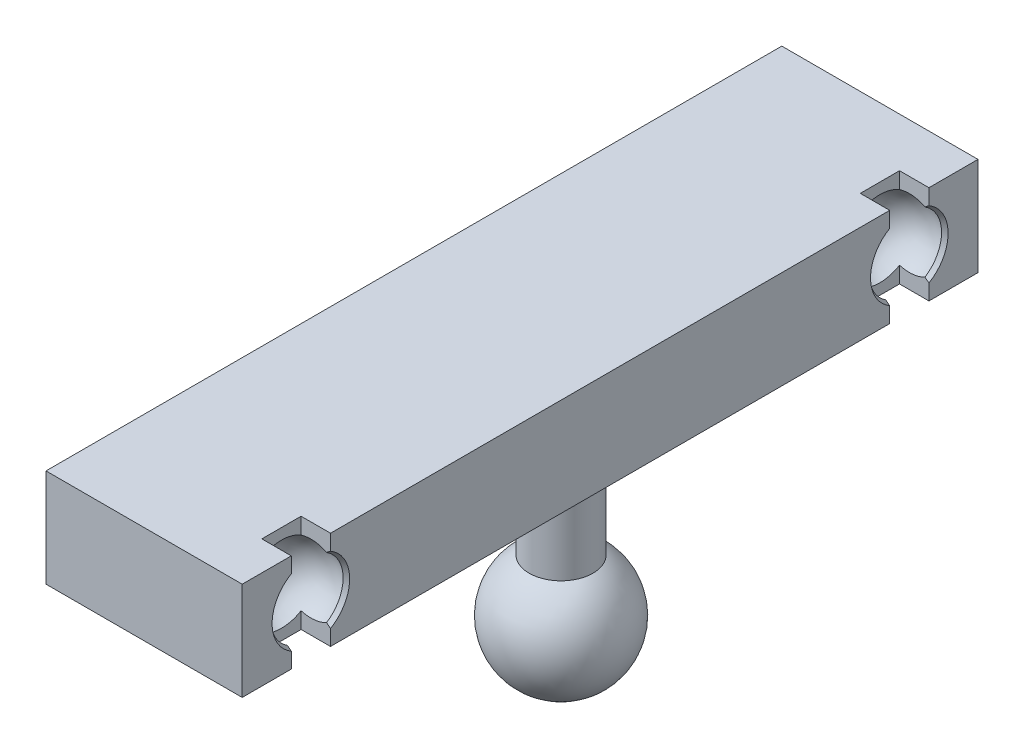
ISO-10303-21;
HEADER;
FILE_DESCRIPTION(('STEP AP214'),'2;1');
FILE_NAME('part.step','',(''),(''),'','','');
FILE_SCHEMA(('AUTOMOTIVE_DESIGN { 1 0 10303 214 1 1 1 1 }'));
ENDSEC;
DATA;
#1=APPLICATION_CONTEXT('core data for automotive mechanical design processes');
#2=APPLICATION_PROTOCOL_DEFINITION('international standard','automotive_design',2000,#1);
#3=PRODUCT_CONTEXT('',#1,'mechanical');
#4=PRODUCT('Part','Part','',(#3));
#5=PRODUCT_RELATED_PRODUCT_CATEGORY('part','',(#4));
#6=PRODUCT_DEFINITION_FORMATION('','',#4);
#7=PRODUCT_DEFINITION_CONTEXT('part definition',#1,'design');
#8=PRODUCT_DEFINITION('design','',#6,#7);
#9=PRODUCT_DEFINITION_SHAPE('','',#8);
#10=(LENGTH_UNIT() NAMED_UNIT(*) SI_UNIT(.MILLI.,.METRE.));
#11=(NAMED_UNIT(*) PLANE_ANGLE_UNIT() SI_UNIT($,.RADIAN.));
#12=(NAMED_UNIT(*) SI_UNIT($,.STERADIAN.) SOLID_ANGLE_UNIT());
#13=UNCERTAINTY_MEASURE_WITH_UNIT(LENGTH_MEASURE(1.E-05),#10,'distance_accuracy_value','');
#14=(GEOMETRIC_REPRESENTATION_CONTEXT(3) GLOBAL_UNCERTAINTY_ASSIGNED_CONTEXT((#13)) GLOBAL_UNIT_ASSIGNED_CONTEXT((#10,
#11,#12)) REPRESENTATION_CONTEXT('',''));
#15=CARTESIAN_POINT('',(0.,0.,0.));
#16=DIRECTION('',(0.,0.,1.));
#17=DIRECTION('',(1.,0.,0.));
#18=AXIS2_PLACEMENT_3D('',#15,#16,#17);
#19=CARTESIAN_POINT('',(5.,24.,37.5));
#20=DIRECTION('',(-1.,0.,0.));
#21=DIRECTION('',(0.,-1.,0.));
#22=AXIS2_PLACEMENT_3D('',#19,#20,#21);
#23=PLANE('',#22);
#24=DIRECTION('',(0.,-1.,0.));
#25=VECTOR('',#24,1.);
#26=CARTESIAN_POINT('',(5.,24.,-28.4999999996869));
#27=LINE('',#26,#25);
#28=CARTESIAN_POINT('',(5.,15.5872673892127,-28.4999999996869));
#29=VERTEX_POINT('',#28);
#30=CARTESIAN_POINT('',(5.,14.,-28.4999999996869));
#31=VERTEX_POINT('',#30);
#32=EDGE_CURVE('E530',#29,#31,#27,.T.);
#33=ORIENTED_EDGE('',*,*,#32,.F.);
#34=CARTESIAN_POINT('',(5.,19.,-30.5));
#35=DIRECTION('',(-1.,0.,0.));
#36=DIRECTION('',(0.,-1.,0.));
#37=AXIS2_PLACEMENT_3D('',#34,#35,#36);
#38=CIRCLE('',#37,3.9555965256815);
#39=CARTESIAN_POINT('',(5.,22.4127326107873,-28.4999999996869));
#40=VERTEX_POINT('',#39);
#41=EDGE_CURVE('E321',#29,#40,#38,.T.);
#42=ORIENTED_EDGE('',*,*,#41,.T.);
#43=CARTESIAN_POINT('',(5.,24.,-28.4999999996869));
#44=VERTEX_POINT('',#43);
#45=EDGE_CURVE('E513',#44,#40,#27,.T.);
#46=ORIENTED_EDGE('',*,*,#45,.F.);
#47=DIRECTION('',(0.,0.,-1.));
#48=VECTOR('',#47,1.);
#49=CARTESIAN_POINT('',(5.,24.,37.5));
#50=LINE('',#49,#48);
#51=CARTESIAN_POINT('',(5.,24.,28.4999999996869));
#52=VERTEX_POINT('',#51);
#53=EDGE_CURVE('E248',#52,#44,#50,.T.);
#54=ORIENTED_EDGE('',*,*,#53,.F.);
#55=DIRECTION('',(0.,-1.,0.));
#56=VECTOR('',#55,1.);
#57=CARTESIAN_POINT('',(5.,24.,28.4999999996869));
#58=LINE('',#57,#56);
#59=CARTESIAN_POINT('',(5.,22.4127326107873,28.4999999996869));
#60=VERTEX_POINT('',#59);
#61=EDGE_CURVE('E567',#52,#60,#58,.T.);
#62=ORIENTED_EDGE('',*,*,#61,.T.);
#63=CARTESIAN_POINT('',(5.,19.,30.5));
#64=DIRECTION('',(-1.,0.,0.));
#65=DIRECTION('',(0.,-1.,0.));
#66=AXIS2_PLACEMENT_3D('',#63,#64,#65);
#67=CIRCLE('',#66,3.95559652568149);
#68=CARTESIAN_POINT('',(5.,15.5872673892127,28.4999999996869));
#69=VERTEX_POINT('',#68);
#70=EDGE_CURVE('E317',#60,#69,#67,.T.);
#71=ORIENTED_EDGE('',*,*,#70,.T.);
#72=CARTESIAN_POINT('',(5.,14.,28.4999999996869));
#73=VERTEX_POINT('',#72);
#74=EDGE_CURVE('E574',#69,#73,#58,.T.);
#75=ORIENTED_EDGE('',*,*,#74,.T.);
#76=DIRECTION('',(0.,0.,-1.));
#77=VECTOR('',#76,1.);
#78=CARTESIAN_POINT('',(5.,14.,37.5));
#79=LINE('',#78,#77);
#80=EDGE_CURVE('E539',#73,#31,#79,.T.);
#81=ORIENTED_EDGE('',*,*,#80,.T.);
#82=EDGE_LOOP('',(#33,#42,#46,#54,#62,#71,#75,#81));
#83=FACE_BOUND('',#82,.T.);
#84=ADVANCED_FACE('F53',(#83),#23,.F.);
#85=DIRECTION('',(0.,-1.,0.));
#86=VECTOR('',#85,1.);
#87=CARTESIAN_POINT('',(5.,24.,32.4999999996869));
#88=LINE('',#87,#86);
#89=CARTESIAN_POINT('',(5.,15.5872673888457,32.4999999996869));
#90=VERTEX_POINT('',#89);
#91=CARTESIAN_POINT('',(5.,14.,32.4999999996869));
#92=VERTEX_POINT('',#91);
#93=EDGE_CURVE('E239',#90,#92,#88,.T.);
#94=ORIENTED_EDGE('',*,*,#93,.F.);
#95=CARTESIAN_POINT('',(5.,19.,30.5));
#96=DIRECTION('',(-1.,0.,0.));
#97=DIRECTION('',(0.,-1.,0.));
#98=AXIS2_PLACEMENT_3D('',#95,#96,#97);
#99=CIRCLE('',#98,3.95559652568149);
#100=CARTESIAN_POINT('',(5.,22.4127326111543,32.4999999996869));
#101=VERTEX_POINT('',#100);
#102=EDGE_CURVE('E236',#90,#101,#99,.T.);
#103=ORIENTED_EDGE('',*,*,#102,.T.);
#104=CARTESIAN_POINT('',(5.,24.,32.4999999996869));
#105=VERTEX_POINT('',#104);
#106=EDGE_CURVE('E222',#105,#101,#88,.T.);
#107=ORIENTED_EDGE('',*,*,#106,.F.);
#108=CARTESIAN_POINT('',(5.,24.,37.5));
#109=VERTEX_POINT('',#108);
#110=EDGE_CURVE('E235',#109,#105,#50,.T.);
#111=ORIENTED_EDGE('',*,*,#110,.F.);
#112=DIRECTION('',(0.,-1.,0.));
#113=VECTOR('',#112,1.);
#114=CARTESIAN_POINT('',(5.,24.,37.5));
#115=LINE('',#114,#113);
#116=CARTESIAN_POINT('',(5.,14.,37.5));
#117=VERTEX_POINT('',#116);
#118=EDGE_CURVE('E272',#109,#117,#115,.T.);
#119=ORIENTED_EDGE('',*,*,#118,.T.);
#120=EDGE_CURVE('E541',#117,#92,#79,.T.);
#121=ORIENTED_EDGE('',*,*,#120,.T.);
#122=EDGE_LOOP('',(#94,#103,#107,#111,#119,#121));
#123=FACE_BOUND('',#122,.T.);
#124=ADVANCED_FACE('F233',(#123),#23,.F.);
#125=CARTESIAN_POINT('',(0.,24.,0.));
#126=DIRECTION('',(0.,-1.,0.));
#127=DIRECTION('',(1.,0.,0.));
#128=AXIS2_PLACEMENT_3D('',#125,#126,#127);
#129=PLANE('',#128);
#130=DIRECTION('',(-1.,0.,0.));
#131=VECTOR('',#130,1.);
#132=CARTESIAN_POINT('',(5.,24.,28.4999999996869));
#133=LINE('',#132,#131);
#134=CARTESIAN_POINT('',(2.,24.,28.4999999996869));
#135=VERTEX_POINT('',#134);
#136=EDGE_CURVE('E605',#52,#135,#133,.T.);
#137=ORIENTED_EDGE('',*,*,#136,.F.);
#138=ORIENTED_EDGE('',*,*,#53,.T.);
#139=DIRECTION('',(-1.,0.,0.));
#140=VECTOR('',#139,1.);
#141=CARTESIAN_POINT('',(5.,24.,-28.4999999996869));
#142=LINE('',#141,#140);
#143=CARTESIAN_POINT('',(2.,24.,-28.4999999996869));
#144=VERTEX_POINT('',#143);
#145=EDGE_CURVE('E580',#44,#144,#142,.T.);
#146=ORIENTED_EDGE('',*,*,#145,.T.);
#147=DIRECTION('',(0.,0.,-1.));
#148=VECTOR('',#147,1.);
#149=CARTESIAN_POINT('',(2.,24.,-32.4999999996869));
#150=LINE('',#149,#148);
#151=CARTESIAN_POINT('',(2.,24.,-32.4999999996869));
#152=VERTEX_POINT('',#151);
#153=EDGE_CURVE('E584',#144,#152,#150,.T.);
#154=ORIENTED_EDGE('',*,*,#153,.T.);
#155=DIRECTION('',(1.,0.,0.));
#156=VECTOR('',#155,1.);
#157=CARTESIAN_POINT('',(5.,24.,-32.4999999996869));
#158=LINE('',#157,#156);
#159=CARTESIAN_POINT('',(5.,24.,-32.4999999996869));
#160=VERTEX_POINT('',#159);
#161=EDGE_CURVE('E587',#152,#160,#158,.T.);
#162=ORIENTED_EDGE('',*,*,#161,.T.);
#163=CARTESIAN_POINT('',(5.,24.,-37.5));
#164=VERTEX_POINT('',#163);
#165=EDGE_CURVE('E250',#160,#164,#50,.T.);
#166=ORIENTED_EDGE('',*,*,#165,.T.);
#167=DIRECTION('',(-1.,0.,0.));
#168=VECTOR('',#167,1.);
#169=CARTESIAN_POINT('',(-15.,24.,-37.5));
#170=LINE('',#169,#168);
#171=CARTESIAN_POINT('',(-15.,24.,-37.5));
#172=VERTEX_POINT('',#171);
#173=EDGE_CURVE('E247',#164,#172,#170,.T.);
#174=ORIENTED_EDGE('',*,*,#173,.T.);
#175=DIRECTION('',(0.,0.,1.));
#176=VECTOR('',#175,1.);
#177=CARTESIAN_POINT('',(-15.,24.,37.5));
#178=LINE('',#177,#176);
#179=CARTESIAN_POINT('',(-15.,24.,37.5));
#180=VERTEX_POINT('',#179);
#181=EDGE_CURVE('E253',#172,#180,#178,.T.);
#182=ORIENTED_EDGE('',*,*,#181,.T.);
#183=DIRECTION('',(1.,0.,0.));
#184=VECTOR('',#183,1.);
#185=CARTESIAN_POINT('',(-15.,24.,37.5));
#186=LINE('',#185,#184);
#187=EDGE_CURVE('E244',#180,#109,#186,.T.);
#188=ORIENTED_EDGE('',*,*,#187,.T.);
#189=ORIENTED_EDGE('',*,*,#110,.T.);
#190=DIRECTION('',(1.,0.,0.));
#191=VECTOR('',#190,1.);
#192=CARTESIAN_POINT('',(5.,24.,32.4999999996869));
#193=LINE('',#192,#191);
#194=CARTESIAN_POINT('',(2.,24.,32.4999999996869));
#195=VERTEX_POINT('',#194);
#196=EDGE_CURVE('E219',#195,#105,#193,.T.);
#197=ORIENTED_EDGE('',*,*,#196,.F.);
#198=DIRECTION('',(0.,0.,1.));
#199=VECTOR('',#198,1.);
#200=CARTESIAN_POINT('',(2.,24.,32.4999999996869));
#201=LINE('',#200,#199);
#202=EDGE_CURVE('E229',#135,#195,#201,.T.);
#203=ORIENTED_EDGE('',*,*,#202,.F.);
#204=EDGE_LOOP('',(#137,#138,#146,#154,#162,#166,#174,#182,#188,#189,#197,#203));
#205=FACE_BOUND('',#204,.T.);
#206=ADVANCED_FACE('F242',(#205),#129,.F.);
#207=CARTESIAN_POINT('',(0.,14.,0.));
#208=DIRECTION('',(0.,-1.,0.));
#209=DIRECTION('',(1.,0.,0.));
#210=AXIS2_PLACEMENT_3D('',#207,#208,#209);
#211=PLANE('',#210);
#212=CARTESIAN_POINT('',(0.,14.,0.));
#213=DIRECTION('',(0.,-1.,0.));
#214=DIRECTION('',(1.,0.,0.));
#215=AXIS2_PLACEMENT_3D('',#212,#213,#214);
#216=CIRCLE('',#215,3.74999999999998);
#217=CARTESIAN_POINT('',(3.74999999999998,14.,0.));
#218=VERTEX_POINT('',#217);
#219=EDGE_CURVE('E63',#218,#218,#216,.F.);
#220=ORIENTED_EDGE('',*,*,#219,.T.);
#221=EDGE_LOOP('',(#220));
#222=FACE_BOUND('',#221,.T.);
#223=ORIENTED_EDGE('',*,*,#80,.F.);
#224=DIRECTION('',(-1.,0.,0.));
#225=VECTOR('',#224,1.);
#226=CARTESIAN_POINT('',(0.,14.,28.4999999996869));
#227=LINE('',#226,#225);
#228=CARTESIAN_POINT('',(2.,14.,28.4999999996869));
#229=VERTEX_POINT('',#228);
#230=EDGE_CURVE('E571',#73,#229,#227,.T.);
#231=ORIENTED_EDGE('',*,*,#230,.T.);
#232=DIRECTION('',(0.,0.,1.));
#233=VECTOR('',#232,1.);
#234=CARTESIAN_POINT('',(2.,14.,0.));
#235=LINE('',#234,#233);
#236=CARTESIAN_POINT('',(2.,14.,32.4999999996869));
#237=VERTEX_POINT('',#236);
#238=EDGE_CURVE('E564',#229,#237,#235,.T.);
#239=ORIENTED_EDGE('',*,*,#238,.T.);
#240=DIRECTION('',(1.,0.,0.));
#241=VECTOR('',#240,1.);
#242=CARTESIAN_POINT('',(0.,14.,32.4999999996869));
#243=LINE('',#242,#241);
#244=EDGE_CURVE('E562',#237,#92,#243,.T.);
#245=ORIENTED_EDGE('',*,*,#244,.T.);
#246=ORIENTED_EDGE('',*,*,#120,.F.);
#247=DIRECTION('',(1.,0.,0.));
#248=VECTOR('',#247,1.);
#249=CARTESIAN_POINT('',(-15.,14.,37.5));
#250=LINE('',#249,#248);
#251=CARTESIAN_POINT('',(-15.,14.,37.5));
#252=VERTEX_POINT('',#251);
#253=EDGE_CURVE('E257',#252,#117,#250,.T.);
#254=ORIENTED_EDGE('',*,*,#253,.F.);
#255=DIRECTION('',(0.,0.,1.));
#256=VECTOR('',#255,1.);
#257=CARTESIAN_POINT('',(-15.,14.,37.5));
#258=LINE('',#257,#256);
#259=CARTESIAN_POINT('',(-15.,14.,-37.5));
#260=VERTEX_POINT('',#259);
#261=EDGE_CURVE('E262',#260,#252,#258,.T.);
#262=ORIENTED_EDGE('',*,*,#261,.F.);
#263=DIRECTION('',(-1.,0.,0.));
#264=VECTOR('',#263,1.);
#265=CARTESIAN_POINT('',(-15.,14.,-37.5));
#266=LINE('',#265,#264);
#267=CARTESIAN_POINT('',(5.,14.,-37.5));
#268=VERTEX_POINT('',#267);
#269=EDGE_CURVE('E268',#268,#260,#266,.T.);
#270=ORIENTED_EDGE('',*,*,#269,.F.);
#271=CARTESIAN_POINT('',(5.,14.,-32.4999999996869));
#272=VERTEX_POINT('',#271);
#273=EDGE_CURVE('E536',#272,#268,#79,.T.);
#274=ORIENTED_EDGE('',*,*,#273,.F.);
#275=DIRECTION('',(1.,0.,0.));
#276=VECTOR('',#275,1.);
#277=CARTESIAN_POINT('',(0.,14.,-32.4999999996869));
#278=LINE('',#277,#276);
#279=CARTESIAN_POINT('',(2.,14.,-32.4999999996869));
#280=VERTEX_POINT('',#279);
#281=EDGE_CURVE('E534',#280,#272,#278,.T.);
#282=ORIENTED_EDGE('',*,*,#281,.F.);
#283=DIRECTION('',(0.,0.,-1.));
#284=VECTOR('',#283,1.);
#285=CARTESIAN_POINT('',(2.,14.,0.));
#286=LINE('',#285,#284);
#287=CARTESIAN_POINT('',(2.,14.,-28.4999999996869));
#288=VERTEX_POINT('',#287);
#289=EDGE_CURVE('E516',#288,#280,#286,.T.);
#290=ORIENTED_EDGE('',*,*,#289,.F.);
#291=DIRECTION('',(-1.,0.,0.));
#292=VECTOR('',#291,1.);
#293=CARTESIAN_POINT('',(0.,14.,-28.4999999996869));
#294=LINE('',#293,#292);
#295=EDGE_CURVE('E485',#31,#288,#294,.T.);
#296=ORIENTED_EDGE('',*,*,#295,.F.);
#297=EDGE_LOOP('',(#223,#231,#239,#245,#246,#254,#262,#270,#274,#282,#290,#296));
#298=FACE_BOUND('',#297,.T.);
#299=ADVANCED_FACE('F475',(#222,#298),#211,.T.);
#300=CARTESIAN_POINT('',(3.,19.,30.5));
#301=DIRECTION('',(0.,0.,-1.));
#302=DIRECTION('',(0.,-1.,0.));
#303=AXIS2_PLACEMENT_3D('',#300,#301,#302);
#304=SPHERICAL_SURFACE('',#303,4.02);
#305=CARTESIAN_POINT('',(3.,19.,28.4999999996869));
#306=DIRECTION('',(0.,0.,1.));
#307=DIRECTION('',(1.,0.,0.));
#308=AXIS2_PLACEMENT_3D('',#305,#306,#307);
#309=CIRCLE('',#308,3.48717650811479);
#310=CARTESIAN_POINT('',(4.59470262770542,15.8988190107739,28.4999999996869));
#311=VERTEX_POINT('',#310);
#312=CARTESIAN_POINT('',(2.,15.6592815145919,28.4999999996869));
#313=VERTEX_POINT('',#312);
#314=EDGE_CURVE('E316',#311,#313,#309,.F.);
#315=ORIENTED_EDGE('',*,*,#314,.F.);
#316=CARTESIAN_POINT('',(4.5947026277054,19.,30.5));
#317=DIRECTION('',(-1.,0.,0.));
#318=DIRECTION('',(0.,0.,1.));
#319=AXIS2_PLACEMENT_3D('',#316,#317,#318);
#320=CIRCLE('',#319,3.69016578613881);
#321=CARTESIAN_POINT('',(4.5947026277054,22.1011809892261,28.4999999996869));
#322=VERTEX_POINT('',#321);
#323=EDGE_CURVE('E439',#311,#322,#320,.F.);
#324=ORIENTED_EDGE('',*,*,#323,.T.);
#325=CARTESIAN_POINT('',(2.,22.3407184854081,28.4999999996869));
#326=VERTEX_POINT('',#325);
#327=EDGE_CURVE('E311',#326,#322,#309,.F.);
#328=ORIENTED_EDGE('',*,*,#327,.F.);
#329=CARTESIAN_POINT('',(2.,19.,30.5));
#330=DIRECTION('',(1.,0.,0.));
#331=DIRECTION('',(0.,1.,0.));
#332=AXIS2_PLACEMENT_3D('',#329,#330,#331);
#333=CIRCLE('',#332,3.89363583299722);
#334=CARTESIAN_POINT('',(2.,22.340718485783,32.4999999996869));
#335=VERTEX_POINT('',#334);
#336=EDGE_CURVE('E307',#335,#326,#333,.F.);
#337=ORIENTED_EDGE('',*,*,#336,.F.);
#338=CARTESIAN_POINT('',(3.,19.,32.4999999996869));
#339=DIRECTION('',(0.,0.,-1.));
#340=DIRECTION('',(-1.,0.,0.));
#341=AXIS2_PLACEMENT_3D('',#338,#339,#340);
#342=CIRCLE('',#341,3.48717650847391);
#343=CARTESIAN_POINT('',(4.5947026277054,22.1011809896299,32.4999999996869));
#344=VERTEX_POINT('',#343);
#345=EDGE_CURVE('E304',#344,#335,#342,.F.);
#346=ORIENTED_EDGE('',*,*,#345,.F.);
#347=CARTESIAN_POINT('',(4.5947026277054,19.,30.5));
#348=DIRECTION('',(-1.,0.,0.));
#349=DIRECTION('',(0.,0.,1.));
#350=AXIS2_PLACEMENT_3D('',#347,#348,#349);
#351=CIRCLE('',#350,3.69016578613881);
#352=CARTESIAN_POINT('',(4.5947026277054,15.8988190103701,32.4999999996869));
#353=VERTEX_POINT('',#352);
#354=EDGE_CURVE('E837',#344,#353,#351,.F.);
#355=ORIENTED_EDGE('',*,*,#354,.T.);
#356=CARTESIAN_POINT('',(2.,15.659281514217,32.4999999996869));
#357=VERTEX_POINT('',#356);
#358=EDGE_CURVE('E308',#357,#353,#342,.F.);
#359=ORIENTED_EDGE('',*,*,#358,.F.);
#360=EDGE_CURVE('E312',#313,#357,#333,.F.);
#361=ORIENTED_EDGE('',*,*,#360,.F.);
#362=EDGE_LOOP('',(#315,#324,#328,#337,#346,#355,#359,#361));
#363=FACE_BOUND('',#362,.T.);
#364=ADVANCED_FACE('F466',(#363),#304,.F.);
#365=DIRECTION('',(0.,-1.,0.));
#366=VECTOR('',#365,1.);
#367=CARTESIAN_POINT('',(5.,24.,-32.4999999996869));
#368=LINE('',#367,#366);
#369=CARTESIAN_POINT('',(5.,22.4127326111543,-32.4999999996869));
#370=VERTEX_POINT('',#369);
#371=EDGE_CURVE('E478',#160,#370,#368,.T.);
#372=ORIENTED_EDGE('',*,*,#371,.T.);
#373=CARTESIAN_POINT('',(5.,19.,-30.5));
#374=DIRECTION('',(-1.,0.,0.));
#375=DIRECTION('',(0.,-1.,0.));
#376=AXIS2_PLACEMENT_3D('',#373,#374,#375);
#377=CIRCLE('',#376,3.9555965256815);
#378=CARTESIAN_POINT('',(5.,15.5872673888457,-32.4999999996869));
#379=VERTEX_POINT('',#378);
#380=EDGE_CURVE('E362',#370,#379,#377,.T.);
#381=ORIENTED_EDGE('',*,*,#380,.T.);
#382=EDGE_CURVE('E486',#379,#272,#368,.T.);
#383=ORIENTED_EDGE('',*,*,#382,.T.);
#384=ORIENTED_EDGE('',*,*,#273,.T.);
#385=DIRECTION('',(0.,-1.,0.));
#386=VECTOR('',#385,1.);
#387=CARTESIAN_POINT('',(5.,24.,-37.5));
#388=LINE('',#387,#386);
#389=EDGE_CURVE('E282',#164,#268,#388,.T.);
#390=ORIENTED_EDGE('',*,*,#389,.F.);
#391=ORIENTED_EDGE('',*,*,#165,.F.);
#392=EDGE_LOOP('',(#372,#381,#383,#384,#390,#391));
#393=FACE_BOUND('',#392,.T.);
#394=ADVANCED_FACE('F457',(#393),#23,.F.);
#395=CARTESIAN_POINT('',(0.,0.,0.));
#396=DIRECTION('',(-1.,0.,0.));
#397=DIRECTION('',(0.,1.,0.));
#398=AXIS2_PLACEMENT_3D('',#395,#396,#397);
#399=SPHERICAL_SURFACE('',#398,6.25);
#400=CARTESIAN_POINT('',(0.,0.,0.));
#401=DIRECTION('',(0.,-1.,0.));
#402=DIRECTION('',(1.,0.,0.));
#403=AXIS2_PLACEMENT_3D('',#400,#401,#402);
#404=SPHERICAL_SURFACE('',#403,6.25);
#405=CARTESIAN_POINT('',(0.,5.33853912601566,0.));
#406=DIRECTION('',(0.,-1.,0.));
#407=DIRECTION('',(1.,0.,0.));
#408=AXIS2_PLACEMENT_3D('',#405,#406,#407);
#409=CIRCLE('',#408,3.25);
#410=CARTESIAN_POINT('',(3.25,5.33853912601566,0.));
#411=VERTEX_POINT('',#410);
#412=EDGE_CURVE('E286',#411,#411,#409,.F.);
#413=ORIENTED_EDGE('',*,*,#412,.F.);
#414=EDGE_LOOP('',(#413));
#415=FACE_BOUND('',#414,.T.);
#416=ADVANCED_FACE('F465',(#415),#404,.T.);
#417=CARTESIAN_POINT('',(0.,14.,0.));
#418=DIRECTION('',(0.,1.,0.));
#419=DIRECTION('',(-1.,0.,0.));
#420=AXIS2_PLACEMENT_3D('',#417,#418,#419);
#421=CYLINDRICAL_SURFACE('',#420,3.25);
#422=CARTESIAN_POINT('',(0.,13.5,0.));
#423=DIRECTION('',(0.,-1.,0.));
#424=DIRECTION('',(1.,0.,0.));
#425=AXIS2_PLACEMENT_3D('',#422,#423,#424);
#426=CIRCLE('',#425,3.25);
#427=CARTESIAN_POINT('',(3.25,13.5,0.));
#428=VERTEX_POINT('',#427);
#429=EDGE_CURVE('E11',#428,#428,#426,.T.);
#430=ORIENTED_EDGE('',*,*,#429,.T.);
#431=EDGE_LOOP('',(#430));
#432=FACE_BOUND('',#431,.T.);
#433=ORIENTED_EDGE('',*,*,#412,.T.);
#434=EDGE_LOOP('',(#433));
#435=FACE_BOUND('',#434,.T.);
#436=ADVANCED_FACE('F473',(#432,#435),#421,.T.);
#437=CARTESIAN_POINT('',(-15.,24.,-37.5));
#438=DIRECTION('',(0.,0.,1.));
#439=DIRECTION('',(1.,0.,0.));
#440=AXIS2_PLACEMENT_3D('',#437,#438,#439);
#441=PLANE('',#440);
#442=ORIENTED_EDGE('',*,*,#269,.T.);
#443=DIRECTION('',(0.,-1.,0.));
#444=VECTOR('',#443,1.);
#445=CARTESIAN_POINT('',(-15.,24.,-37.5));
#446=LINE('',#445,#444);
#447=EDGE_CURVE('E278',#172,#260,#446,.T.);
#448=ORIENTED_EDGE('',*,*,#447,.F.);
#449=ORIENTED_EDGE('',*,*,#173,.F.);
#450=ORIENTED_EDGE('',*,*,#389,.T.);
#451=EDGE_LOOP('',(#442,#448,#449,#450));
#452=FACE_BOUND('',#451,.T.);
#453=ADVANCED_FACE('F552',(#452),#441,.F.);
#454=CARTESIAN_POINT('',(-15.,24.,37.5));
#455=DIRECTION('',(1.,0.,0.));
#456=DIRECTION('',(0.,1.,0.));
#457=AXIS2_PLACEMENT_3D('',#454,#455,#456);
#458=PLANE('',#457);
#459=ORIENTED_EDGE('',*,*,#261,.T.);
#460=DIRECTION('',(0.,-1.,0.));
#461=VECTOR('',#460,1.);
#462=CARTESIAN_POINT('',(-15.,24.,37.5));
#463=LINE('',#462,#461);
#464=EDGE_CURVE('E275',#180,#252,#463,.T.);
#465=ORIENTED_EDGE('',*,*,#464,.F.);
#466=ORIENTED_EDGE('',*,*,#181,.F.);
#467=ORIENTED_EDGE('',*,*,#447,.T.);
#468=EDGE_LOOP('',(#459,#465,#466,#467));
#469=FACE_BOUND('',#468,.T.);
#470=ADVANCED_FACE('F557',(#469),#458,.F.);
#471=CARTESIAN_POINT('',(-15.,24.,37.5));
#472=DIRECTION('',(0.,0.,-1.));
#473=DIRECTION('',(-1.,0.,0.));
#474=AXIS2_PLACEMENT_3D('',#471,#472,#473);
#475=PLANE('',#474);
#476=ORIENTED_EDGE('',*,*,#253,.T.);
#477=ORIENTED_EDGE('',*,*,#118,.F.);
#478=ORIENTED_EDGE('',*,*,#187,.F.);
#479=ORIENTED_EDGE('',*,*,#464,.T.);
#480=EDGE_LOOP('',(#476,#477,#478,#479));
#481=FACE_BOUND('',#480,.T.);
#482=ADVANCED_FACE('F796',(#481),#475,.F.);
#483=CARTESIAN_POINT('',(3.,19.,-30.5));
#484=DIRECTION('',(0.,0.,-1.));
#485=DIRECTION('',(0.,1.,0.));
#486=AXIS2_PLACEMENT_3D('',#483,#484,#485);
#487=SPHERICAL_SURFACE('',#486,4.02);
#488=CARTESIAN_POINT('',(3.,19.,-28.4999999996869));
#489=DIRECTION('',(0.,0.,1.));
#490=DIRECTION('',(1.,0.,0.));
#491=AXIS2_PLACEMENT_3D('',#488,#489,#490);
#492=CIRCLE('',#491,3.48717650811478);
#493=CARTESIAN_POINT('',(2.,22.3407184854081,-28.4999999996869));
#494=VERTEX_POINT('',#493);
#495=CARTESIAN_POINT('',(4.5947026277054,22.1011809892261,-28.4999999996869));
#496=VERTEX_POINT('',#495);
#497=EDGE_CURVE('E290',#494,#496,#492,.F.);
#498=ORIENTED_EDGE('',*,*,#497,.T.);
#499=CARTESIAN_POINT('',(4.5947026277054,19.,-30.5));
#500=DIRECTION('',(-1.,0.,0.));
#501=DIRECTION('',(0.,0.,1.));
#502=AXIS2_PLACEMENT_3D('',#499,#500,#501);
#503=CIRCLE('',#502,3.69016578613882);
#504=CARTESIAN_POINT('',(4.5947026277054,15.8988190107739,-28.4999999996869));
#505=VERTEX_POINT('',#504);
#506=EDGE_CURVE('E363',#496,#505,#503,.F.);
#507=ORIENTED_EDGE('',*,*,#506,.T.);
#508=CARTESIAN_POINT('',(2.,15.6592815145919,-28.4999999996869));
#509=VERTEX_POINT('',#508);
#510=EDGE_CURVE('E295',#505,#509,#492,.F.);
#511=ORIENTED_EDGE('',*,*,#510,.T.);
#512=CARTESIAN_POINT('',(2.,19.,-30.5));
#513=DIRECTION('',(-1.,0.,0.));
#514=DIRECTION('',(0.,-1.,0.));
#515=AXIS2_PLACEMENT_3D('',#512,#513,#514);
#516=CIRCLE('',#515,3.89363583299723);
#517=CARTESIAN_POINT('',(2.,15.659281514217,-32.4999999996869));
#518=VERTEX_POINT('',#517);
#519=EDGE_CURVE('E300',#509,#518,#516,.F.);
#520=ORIENTED_EDGE('',*,*,#519,.T.);
#521=CARTESIAN_POINT('',(3.,19.,-32.4999999996869));
#522=DIRECTION('',(0.,0.,-1.));
#523=DIRECTION('',(-1.,0.,0.));
#524=AXIS2_PLACEMENT_3D('',#521,#522,#523);
#525=CIRCLE('',#524,3.48717650847393);
#526=CARTESIAN_POINT('',(4.5947026277054,15.8988190103701,-32.4999999996869));
#527=VERTEX_POINT('',#526);
#528=EDGE_CURVE('E303',#518,#527,#525,.F.);
#529=ORIENTED_EDGE('',*,*,#528,.T.);
#530=CARTESIAN_POINT('',(4.5947026277054,19.,-30.5));
#531=DIRECTION('',(-1.,0.,0.));
#532=DIRECTION('',(0.,0.,1.));
#533=AXIS2_PLACEMENT_3D('',#530,#531,#532);
#534=CIRCLE('',#533,3.69016578613882);
#535=CARTESIAN_POINT('',(4.5947026277054,22.1011809896299,-32.4999999996869));
#536=VERTEX_POINT('',#535);
#537=EDGE_CURVE('E334',#527,#536,#534,.F.);
#538=ORIENTED_EDGE('',*,*,#537,.T.);
#539=CARTESIAN_POINT('',(2.,22.340718485783,-32.4999999996869));
#540=VERTEX_POINT('',#539);
#541=EDGE_CURVE('E299',#536,#540,#525,.F.);
#542=ORIENTED_EDGE('',*,*,#541,.T.);
#543=EDGE_CURVE('E294',#540,#494,#516,.F.);
#544=ORIENTED_EDGE('',*,*,#543,.T.);
#545=EDGE_LOOP('',(#498,#507,#511,#520,#529,#538,#542,#544));
#546=FACE_BOUND('',#545,.T.);
#547=ADVANCED_FACE('F351',(#546),#487,.F.);
#548=CARTESIAN_POINT('',(5.,24.,-28.4999999996869));
#549=DIRECTION('',(0.,0.,1.));
#550=DIRECTION('',(1.,0.,0.));
#551=AXIS2_PLACEMENT_3D('',#548,#549,#550);
#552=PLANE('',#551);
#553=ORIENTED_EDGE('',*,*,#45,.T.);
#554=CARTESIAN_POINT('',(5.,22.4127326107873,-28.4999999996869));
#555=CARTESIAN_POINT('',(4.93212148824994,22.3612353197673,-28.4999999996869));
#556=CARTESIAN_POINT('',(4.86440746306171,22.3095240482483,-28.4999999996869));
#557=CARTESIAN_POINT('',(4.72930833873425,22.2056735080261,-28.4999999996869));
#558=CARTESIAN_POINT('',(4.66192323982428,22.1535342390247,-28.4999999996869));
#559=CARTESIAN_POINT('',(4.5947026277054,22.1011809892261,-28.4999999996869));
#560=B_SPLINE_CURVE_WITH_KNOTS('',3,(#554,#555,#556,#557,#558,#559),.UNSPECIFIED.,.F.,.F.,(4,2,
4),(0.,0.255603605772181,0.511207389672125),.UNSPECIFIED.);
#561=EDGE_CURVE('E325',#40,#496,#560,.T.);
#562=ORIENTED_EDGE('',*,*,#561,.T.);
#563=ORIENTED_EDGE('',*,*,#497,.F.);
#564=DIRECTION('',(0.,-1.,0.));
#565=VECTOR('',#564,1.);
#566=CARTESIAN_POINT('',(2.,24.,-28.4999999996869));
#567=LINE('',#566,#565);
#568=EDGE_CURVE('E512',#144,#494,#567,.T.);
#569=ORIENTED_EDGE('',*,*,#568,.F.);
#570=ORIENTED_EDGE('',*,*,#145,.F.);
#571=EDGE_LOOP('',(#553,#562,#563,#569,#570));
#572=FACE_BOUND('',#571,.T.);
#573=ADVANCED_FACE('F348',(#572),#552,.F.);
#574=CARTESIAN_POINT('',(2.,24.,-32.4999999996869));
#575=DIRECTION('',(-1.,0.,0.));
#576=DIRECTION('',(0.,-1.,0.));
#577=AXIS2_PLACEMENT_3D('',#574,#575,#576);
#578=PLANE('',#577);
#579=DIRECTION('',(0.,-1.,0.));
#580=VECTOR('',#579,1.);
#581=CARTESIAN_POINT('',(2.,24.,-32.4999999996869));
#582=LINE('',#581,#580);
#583=EDGE_CURVE('E519',#152,#540,#582,.T.);
#584=ORIENTED_EDGE('',*,*,#583,.F.);
#585=ORIENTED_EDGE('',*,*,#153,.F.);
#586=ORIENTED_EDGE('',*,*,#568,.T.);
#587=ORIENTED_EDGE('',*,*,#543,.F.);
#588=EDGE_LOOP('',(#584,#585,#586,#587));
#589=FACE_BOUND('',#588,.T.);
#590=ADVANCED_FACE('F349',(#589),#578,.F.);
#591=CARTESIAN_POINT('',(5.,24.,-32.4999999996869));
#592=DIRECTION('',(0.,0.,-1.));
#593=DIRECTION('',(-1.,0.,0.));
#594=AXIS2_PLACEMENT_3D('',#591,#592,#593);
#595=PLANE('',#594);
#596=ORIENTED_EDGE('',*,*,#541,.F.);
#597=CARTESIAN_POINT('',(4.5947026277054,22.1011809896299,-32.4999999996869));
#598=CARTESIAN_POINT('',(4.66192323982462,22.153534239422,-32.4999999996869));
#599=CARTESIAN_POINT('',(4.72930833873475,22.2056735084171,-32.4999999996869));
#600=CARTESIAN_POINT('',(4.86440746306221,22.309524048627,-32.4999999996869));
#601=CARTESIAN_POINT('',(4.93212148825027,22.36123532014,-32.4999999996869));
#602=CARTESIAN_POINT('',(5.,22.4127326111543,-32.4999999996869));
#603=B_SPLINE_CURVE_WITH_KNOTS('',3,(#597,#598,#599,#600,#601,#602),.UNSPECIFIED.,.F.,.F.,(4,2,
4),(0.,0.255603783888705,0.511207389649651),.UNSPECIFIED.);
#604=EDGE_CURVE('E374',#536,#370,#603,.T.);
#605=ORIENTED_EDGE('',*,*,#604,.T.);
#606=ORIENTED_EDGE('',*,*,#371,.F.);
#607=ORIENTED_EDGE('',*,*,#161,.F.);
#608=ORIENTED_EDGE('',*,*,#583,.T.);
#609=EDGE_LOOP('',(#596,#605,#606,#607,#608));
#610=FACE_BOUND('',#609,.T.);
#611=ADVANCED_FACE('F388',(#610),#595,.F.);
#612=ORIENTED_EDGE('',*,*,#382,.F.);
#613=CARTESIAN_POINT('',(5.,15.5872673888457,-32.4999999996869));
#614=CARTESIAN_POINT('',(4.93212148825028,15.63876467986,-32.4999999996869));
#615=CARTESIAN_POINT('',(4.86440746306221,15.690475951373,-32.4999999996869));
#616=CARTESIAN_POINT('',(4.72930833873475,15.7943264915829,-32.4999999996869));
#617=CARTESIAN_POINT('',(4.66192323982462,15.846465760578,-32.4999999996869));
#618=CARTESIAN_POINT('',(4.5947026277054,15.8988190103701,-32.4999999996869));
#619=B_SPLINE_CURVE_WITH_KNOTS('',3,(#613,#614,#615,#616,#617,#618),.UNSPECIFIED.,.F.,.F.,(4,2,
4),(0.,0.255603605760946,0.511207389649651),.UNSPECIFIED.);
#620=EDGE_CURVE('E367',#379,#527,#619,.T.);
#621=ORIENTED_EDGE('',*,*,#620,.T.);
#622=ORIENTED_EDGE('',*,*,#528,.F.);
#623=EDGE_CURVE('E515',#518,#280,#582,.T.);
#624=ORIENTED_EDGE('',*,*,#623,.T.);
#625=ORIENTED_EDGE('',*,*,#281,.T.);
#626=EDGE_LOOP('',(#612,#621,#622,#624,#625));
#627=FACE_BOUND('',#626,.T.);
#628=ADVANCED_FACE('F384',(#627),#595,.F.);
#629=ORIENTED_EDGE('',*,*,#289,.T.);
#630=ORIENTED_EDGE('',*,*,#623,.F.);
#631=ORIENTED_EDGE('',*,*,#519,.F.);
#632=EDGE_CURVE('E507',#509,#288,#567,.T.);
#633=ORIENTED_EDGE('',*,*,#632,.T.);
#634=EDGE_LOOP('',(#629,#630,#631,#633));
#635=FACE_BOUND('',#634,.T.);
#636=ADVANCED_FACE('F346',(#635),#578,.F.);
#637=ORIENTED_EDGE('',*,*,#510,.F.);
#638=CARTESIAN_POINT('',(4.5947026277054,15.8988190107739,-28.4999999996869));
#639=CARTESIAN_POINT('',(4.66192323982428,15.8464657609753,-28.4999999996869));
#640=CARTESIAN_POINT('',(4.72930833873425,15.7943264919739,-28.4999999996869));
#641=CARTESIAN_POINT('',(4.86440746306171,15.6904759517517,-28.4999999996869));
#642=CARTESIAN_POINT('',(4.93212148824994,15.6387646802327,-28.4999999996869));
#643=CARTESIAN_POINT('',(5.,15.5872673892127,-28.4999999996869));
#644=B_SPLINE_CURVE_WITH_KNOTS('',3,(#638,#639,#640,#641,#642,#643),.UNSPECIFIED.,.F.,.F.,(4,2,
4),(0.,0.255603783899945,0.511207389672129),.UNSPECIFIED.);
#645=EDGE_CURVE('E355',#505,#29,#644,.T.);
#646=ORIENTED_EDGE('',*,*,#645,.T.);
#647=ORIENTED_EDGE('',*,*,#32,.T.);
#648=ORIENTED_EDGE('',*,*,#295,.T.);
#649=ORIENTED_EDGE('',*,*,#632,.F.);
#650=EDGE_LOOP('',(#637,#646,#647,#648,#649));
#651=FACE_BOUND('',#650,.T.);
#652=ADVANCED_FACE('F341',(#651),#552,.F.);
#653=CARTESIAN_POINT('',(5.,24.,32.4999999996869));
#654=DIRECTION('',(0.,0.,-1.));
#655=DIRECTION('',(-1.,0.,0.));
#656=AXIS2_PLACEMENT_3D('',#653,#654,#655);
#657=PLANE('',#656);
#658=ORIENTED_EDGE('',*,*,#106,.T.);
#659=CARTESIAN_POINT('',(5.,22.4127326111543,32.4999999996869));
#660=CARTESIAN_POINT('',(4.93212148825027,22.36123532014,32.4999999996869));
#661=CARTESIAN_POINT('',(4.86440746306221,22.3095240486269,32.4999999996869));
#662=CARTESIAN_POINT('',(4.72930833873475,22.2056735084171,32.4999999996869));
#663=CARTESIAN_POINT('',(4.66192323982462,22.153534239422,32.4999999996869));
#664=CARTESIAN_POINT('',(4.5947026277054,22.1011809896299,32.4999999996869));
#665=B_SPLINE_CURVE_WITH_KNOTS('',3,(#659,#660,#661,#662,#663,#664),.UNSPECIFIED.,.F.,.F.,(4,2,
4),(0.,0.255603605760945,0.511207389649652),.UNSPECIFIED.);
#666=EDGE_CURVE('E78',#101,#344,#665,.T.);
#667=ORIENTED_EDGE('',*,*,#666,.T.);
#668=ORIENTED_EDGE('',*,*,#345,.T.);
#669=DIRECTION('',(0.,-1.,0.));
#670=VECTOR('',#669,1.);
#671=CARTESIAN_POINT('',(2.,24.,32.4999999996869));
#672=LINE('',#671,#670);
#673=EDGE_CURVE('E224',#195,#335,#672,.T.);
#674=ORIENTED_EDGE('',*,*,#673,.F.);
#675=ORIENTED_EDGE('',*,*,#196,.T.);
#676=EDGE_LOOP('',(#658,#667,#668,#674,#675));
#677=FACE_BOUND('',#676,.T.);
#678=ADVANCED_FACE('F221',(#677),#657,.T.);
#679=CARTESIAN_POINT('',(2.,24.,32.4999999996869));
#680=DIRECTION('',(1.,0.,0.));
#681=DIRECTION('',(0.,1.,0.));
#682=AXIS2_PLACEMENT_3D('',#679,#680,#681);
#683=PLANE('',#682);
#684=ORIENTED_EDGE('',*,*,#336,.T.);
#685=DIRECTION('',(0.,-1.,0.));
#686=VECTOR('',#685,1.);
#687=CARTESIAN_POINT('',(2.,24.,28.4999999996869));
#688=LINE('',#687,#686);
#689=EDGE_CURVE('E599',#135,#326,#688,.T.);
#690=ORIENTED_EDGE('',*,*,#689,.F.);
#691=ORIENTED_EDGE('',*,*,#202,.T.);
#692=ORIENTED_EDGE('',*,*,#673,.T.);
#693=EDGE_LOOP('',(#684,#690,#691,#692));
#694=FACE_BOUND('',#693,.T.);
#695=ADVANCED_FACE('F451',(#694),#683,.T.);
#696=CARTESIAN_POINT('',(5.,24.,28.4999999996869));
#697=DIRECTION('',(0.,0.,1.));
#698=DIRECTION('',(1.,0.,0.));
#699=AXIS2_PLACEMENT_3D('',#696,#697,#698);
#700=PLANE('',#699);
#701=ORIENTED_EDGE('',*,*,#327,.T.);
#702=CARTESIAN_POINT('',(4.5947026277054,22.1011809892261,28.4999999996869));
#703=CARTESIAN_POINT('',(4.66192323982428,22.1535342390247,28.4999999996869));
#704=CARTESIAN_POINT('',(4.72930833873425,22.2056735080261,28.4999999996869));
#705=CARTESIAN_POINT('',(4.86440746306171,22.3095240482483,28.4999999996869));
#706=CARTESIAN_POINT('',(4.93212148824994,22.3612353197673,28.4999999996869));
#707=CARTESIAN_POINT('',(5.,22.4127326107873,28.4999999996869));
#708=B_SPLINE_CURVE_WITH_KNOTS('',3,(#702,#703,#704,#705,#706,#707),.UNSPECIFIED.,.F.,.F.,(4,2,
4),(0.,0.255603783899946,0.511207389672126),.UNSPECIFIED.);
#709=EDGE_CURVE('E432',#322,#60,#708,.T.);
#710=ORIENTED_EDGE('',*,*,#709,.T.);
#711=ORIENTED_EDGE('',*,*,#61,.F.);
#712=ORIENTED_EDGE('',*,*,#136,.T.);
#713=ORIENTED_EDGE('',*,*,#689,.T.);
#714=EDGE_LOOP('',(#701,#710,#711,#712,#713));
#715=FACE_BOUND('',#714,.T.);
#716=ADVANCED_FACE('F443',(#715),#700,.T.);
#717=ORIENTED_EDGE('',*,*,#74,.F.);
#718=CARTESIAN_POINT('',(5.,15.5872673892127,28.4999999996869));
#719=CARTESIAN_POINT('',(4.93212148824994,15.6387646802327,28.4999999996869));
#720=CARTESIAN_POINT('',(4.8644074630617,15.6904759517517,28.4999999996869));
#721=CARTESIAN_POINT('',(4.72930833873423,15.7943264919739,28.4999999996869));
#722=CARTESIAN_POINT('',(4.66192323982426,15.8464657609753,28.4999999996869));
#723=CARTESIAN_POINT('',(4.59470262770537,15.8988190107739,28.4999999996869));
#724=B_SPLINE_CURVE_WITH_KNOTS('',3,(#718,#719,#720,#721,#722,#723),.UNSPECIFIED.,.F.,.F.,(4,2,
4),(0.,0.2556036057722,0.511207389672155),.UNSPECIFIED.);
#725=EDGE_CURVE('E425',#69,#311,#724,.T.);
#726=ORIENTED_EDGE('',*,*,#725,.T.);
#727=ORIENTED_EDGE('',*,*,#314,.T.);
#728=EDGE_CURVE('E594',#313,#229,#688,.T.);
#729=ORIENTED_EDGE('',*,*,#728,.T.);
#730=ORIENTED_EDGE('',*,*,#230,.F.);
#731=EDGE_LOOP('',(#717,#726,#727,#729,#730));
#732=FACE_BOUND('',#731,.T.);
#733=ADVANCED_FACE('F440',(#732),#700,.T.);
#734=ORIENTED_EDGE('',*,*,#728,.F.);
#735=ORIENTED_EDGE('',*,*,#360,.T.);
#736=EDGE_CURVE('E238',#357,#237,#672,.T.);
#737=ORIENTED_EDGE('',*,*,#736,.T.);
#738=ORIENTED_EDGE('',*,*,#238,.F.);
#739=EDGE_LOOP('',(#734,#735,#737,#738));
#740=FACE_BOUND('',#739,.T.);
#741=ADVANCED_FACE('F395',(#740),#683,.T.);
#742=ORIENTED_EDGE('',*,*,#358,.T.);
#743=CARTESIAN_POINT('',(4.5947026277054,15.8988190103701,32.4999999996869));
#744=CARTESIAN_POINT('',(4.66192323982462,15.846465760578,32.4999999996869));
#745=CARTESIAN_POINT('',(4.72930833873475,15.7943264915829,32.4999999996869));
#746=CARTESIAN_POINT('',(4.86440746306221,15.6904759513731,32.4999999996869));
#747=CARTESIAN_POINT('',(4.93212148825027,15.63876467986,32.4999999996869));
#748=CARTESIAN_POINT('',(5.,15.5872673888457,32.4999999996869));
#749=B_SPLINE_CURVE_WITH_KNOTS('',3,(#743,#744,#745,#746,#747,#748),.UNSPECIFIED.,.F.,.F.,(4,2,
4),(0.,0.255603783888706,0.511207389649652),.UNSPECIFIED.);
#750=EDGE_CURVE('E70',#353,#90,#749,.T.);
#751=ORIENTED_EDGE('',*,*,#750,.T.);
#752=ORIENTED_EDGE('',*,*,#93,.T.);
#753=ORIENTED_EDGE('',*,*,#244,.F.);
#754=ORIENTED_EDGE('',*,*,#736,.F.);
#755=EDGE_LOOP('',(#742,#751,#752,#753,#754));
#756=FACE_BOUND('',#755,.T.);
#757=ADVANCED_FACE('F390',(#756),#657,.T.);
#758=CARTESIAN_POINT('',(5.,19.,-30.5));
#759=DIRECTION('',(1.,0.,0.));
#760=DIRECTION('',(0.,0.,-1.));
#761=AXIS2_PLACEMENT_3D('',#758,#759,#760);
#762=CONICAL_SURFACE('',#761,3.9555965256815,0.579814724975282);
#763=ORIENTED_EDGE('',*,*,#645,.F.);
#764=ORIENTED_EDGE('',*,*,#506,.F.);
#765=ORIENTED_EDGE('',*,*,#561,.F.);
#766=ORIENTED_EDGE('',*,*,#41,.F.);
#767=EDGE_LOOP('',(#763,#764,#765,#766));
#768=FACE_BOUND('',#767,.T.);
#769=ADVANCED_FACE('F337',(#768),#762,.F.);
#770=CARTESIAN_POINT('',(5.,19.,-30.5));
#771=DIRECTION('',(1.,0.,0.));
#772=DIRECTION('',(0.,0.,-1.));
#773=AXIS2_PLACEMENT_3D('',#770,#771,#772);
#774=CONICAL_SURFACE('',#773,3.9555965256815,0.579814724975282);
#775=ORIENTED_EDGE('',*,*,#604,.F.);
#776=ORIENTED_EDGE('',*,*,#537,.F.);
#777=ORIENTED_EDGE('',*,*,#620,.F.);
#778=ORIENTED_EDGE('',*,*,#380,.F.);
#779=EDGE_LOOP('',(#775,#776,#777,#778));
#780=FACE_BOUND('',#779,.T.);
#781=ADVANCED_FACE('F381',(#780),#774,.F.);
#782=CARTESIAN_POINT('',(5.,19.,30.5));
#783=DIRECTION('',(1.,0.,0.));
#784=DIRECTION('',(0.,0.,-1.));
#785=AXIS2_PLACEMENT_3D('',#782,#783,#784);
#786=CONICAL_SURFACE('',#785,3.95559652568149,0.579814724975281);
#787=ORIENTED_EDGE('',*,*,#709,.F.);
#788=ORIENTED_EDGE('',*,*,#323,.F.);
#789=ORIENTED_EDGE('',*,*,#725,.F.);
#790=ORIENTED_EDGE('',*,*,#70,.F.);
#791=EDGE_LOOP('',(#787,#788,#789,#790));
#792=FACE_BOUND('',#791,.T.);
#793=ADVANCED_FACE('F417',(#792),#786,.F.);
#794=CARTESIAN_POINT('',(5.,19.,30.5));
#795=DIRECTION('',(1.,0.,0.));
#796=DIRECTION('',(0.,0.,-1.));
#797=AXIS2_PLACEMENT_3D('',#794,#795,#796);
#798=CONICAL_SURFACE('',#797,3.95559652568149,0.579814724975281);
#799=ORIENTED_EDGE('',*,*,#750,.F.);
#800=ORIENTED_EDGE('',*,*,#354,.F.);
#801=ORIENTED_EDGE('',*,*,#666,.F.);
#802=ORIENTED_EDGE('',*,*,#102,.F.);
#803=EDGE_LOOP('',(#799,#800,#801,#802));
#804=FACE_BOUND('',#803,.T.);
#805=ADVANCED_FACE('F411',(#804),#798,.F.);
#806=CARTESIAN_POINT('',(0.,14.,0.));
#807=DIRECTION('',(0.,1.,0.));
#808=DIRECTION('',(-1.,0.,0.));
#809=AXIS2_PLACEMENT_3D('',#806,#807,#808);
#810=CONICAL_SURFACE('',#809,3.74999999999998,0.78539816339745);
#811=ORIENTED_EDGE('',*,*,#429,.F.);
#812=EDGE_LOOP('',(#811));
#813=FACE_BOUND('',#812,.T.);
#814=ORIENTED_EDGE('',*,*,#219,.F.);
#815=EDGE_LOOP('',(#814));
#816=FACE_BOUND('',#815,.T.);
#817=ADVANCED_FACE('F56',(#813,#816),#810,.T.);
#818=CLOSED_SHELL('',(#84,#124,#206,#299,#364,#394,#416,#436,#453,#470,#482,#547,#573,#590,#611,
#628,#636,#652,#678,#695,#716,#733,#741,#757,#769,#781,#793,#805,#817));
#819=MANIFOLD_SOLID_BREP('B2',#818);
#820=ADVANCED_BREP_SHAPE_REPRESENTATION('',(#18,#819),#14);
#821=SHAPE_DEFINITION_REPRESENTATION(#9,#820);
ENDSEC;
END-ISO-10303-21;
